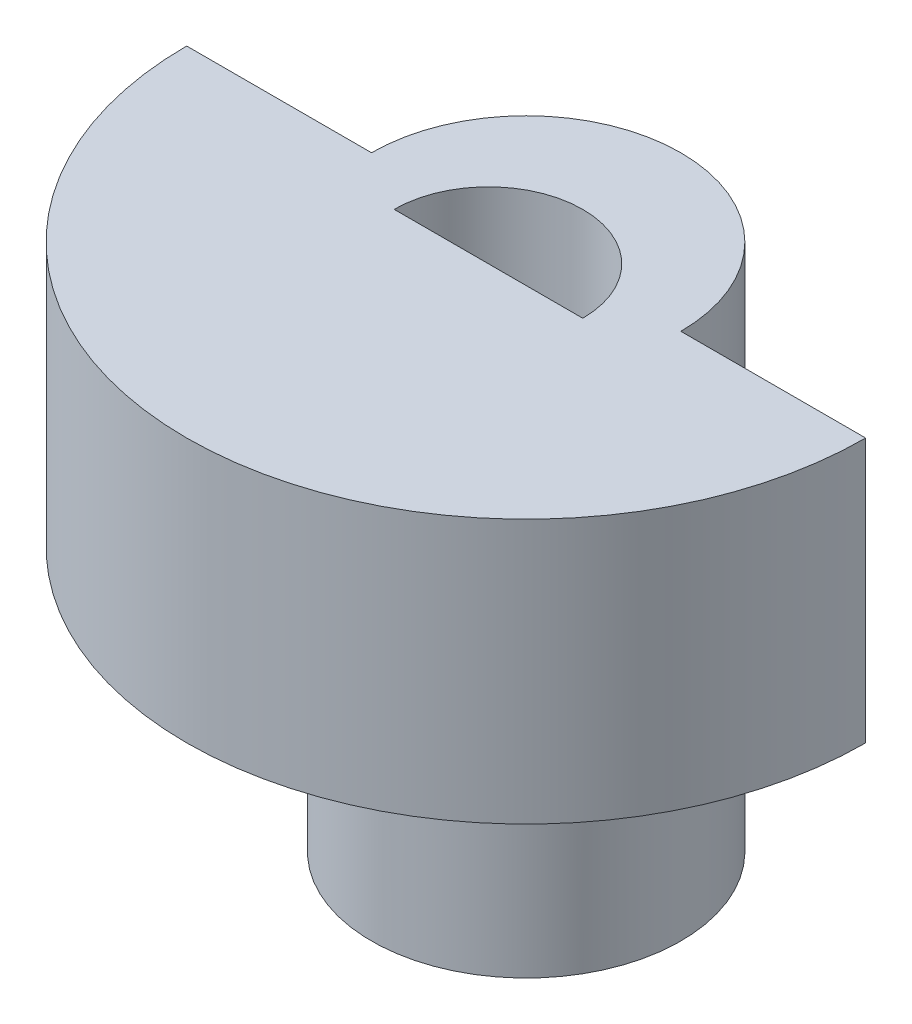
ISO-10303-21;
HEADER;
FILE_DESCRIPTION(('STEP AP214'),'2;1');
FILE_NAME('part.step','',(''),(''),'','','');
FILE_SCHEMA(('AUTOMOTIVE_DESIGN { 1 0 10303 214 1 1 1 1 }'));
ENDSEC;
DATA;
#1=APPLICATION_CONTEXT('core data for automotive mechanical design processes');
#2=APPLICATION_PROTOCOL_DEFINITION('international standard','automotive_design',2000,#1);
#3=PRODUCT_CONTEXT('',#1,'mechanical');
#4=PRODUCT('Part','Part','',(#3));
#5=PRODUCT_RELATED_PRODUCT_CATEGORY('part','',(#4));
#6=PRODUCT_DEFINITION_FORMATION('','',#4);
#7=PRODUCT_DEFINITION_CONTEXT('part definition',#1,'design');
#8=PRODUCT_DEFINITION('design','',#6,#7);
#9=PRODUCT_DEFINITION_SHAPE('','',#8);
#10=(LENGTH_UNIT() NAMED_UNIT(*) SI_UNIT(.MILLI.,.METRE.));
#11=(NAMED_UNIT(*) PLANE_ANGLE_UNIT() SI_UNIT($,.RADIAN.));
#12=(NAMED_UNIT(*) SI_UNIT($,.STERADIAN.) SOLID_ANGLE_UNIT());
#13=UNCERTAINTY_MEASURE_WITH_UNIT(LENGTH_MEASURE(1.E-05),#10,'distance_accuracy_value','');
#14=(GEOMETRIC_REPRESENTATION_CONTEXT(3) GLOBAL_UNCERTAINTY_ASSIGNED_CONTEXT((#13)) GLOBAL_UNIT_ASSIGNED_CONTEXT((#10,
#11,#12)) REPRESENTATION_CONTEXT('',''));
#15=CARTESIAN_POINT('',(0.,0.,0.));
#16=DIRECTION('',(0.,0.,1.));
#17=DIRECTION('',(1.,0.,0.));
#18=AXIS2_PLACEMENT_3D('',#15,#16,#17);
#19=CARTESIAN_POINT('',(0.,0.,0.));
#20=DIRECTION('',(0.,1.,0.));
#21=DIRECTION('',(0.,0.,1.));
#22=AXIS2_PLACEMENT_3D('',#19,#20,#21);
#23=PLANE('',#22);
#24=CARTESIAN_POINT('',(0.,0.,0.));
#25=DIRECTION('',(0.,-1.,0.));
#26=DIRECTION('',(0.,0.,-1.));
#27=AXIS2_PLACEMENT_3D('',#24,#25,#26);
#28=CIRCLE('',#27,4.1);
#29=CARTESIAN_POINT('',(4.1,0.,0.));
#30=VERTEX_POINT('',#29);
#31=CARTESIAN_POINT('',(-4.1,0.,0.));
#32=VERTEX_POINT('',#31);
#33=EDGE_CURVE('E104',#30,#32,#28,.T.);
#34=ORIENTED_EDGE('',*,*,#33,.F.);
#35=DIRECTION('',(-1.,0.,0.));
#36=VECTOR('',#35,1.);
#37=CARTESIAN_POINT('',(4.1,0.,0.));
#38=LINE('',#37,#36);
#39=CARTESIAN_POINT('',(9.,0.,0.));
#40=VERTEX_POINT('',#39);
#41=EDGE_CURVE('E124',#40,#30,#38,.T.);
#42=ORIENTED_EDGE('',*,*,#41,.F.);
#43=CARTESIAN_POINT('',(0.,0.,0.));
#44=DIRECTION('',(0.,1.,0.));
#45=DIRECTION('',(0.,0.,1.));
#46=AXIS2_PLACEMENT_3D('',#43,#44,#45);
#47=CIRCLE('',#46,9.);
#48=CARTESIAN_POINT('',(-9.,0.,0.));
#49=VERTEX_POINT('',#48);
#50=EDGE_CURVE('E119',#49,#40,#47,.T.);
#51=ORIENTED_EDGE('',*,*,#50,.F.);
#52=DIRECTION('',(-1.,0.,0.));
#53=VECTOR('',#52,1.);
#54=CARTESIAN_POINT('',(-4.1,0.,0.));
#55=LINE('',#54,#53);
#56=EDGE_CURVE('E109',#32,#49,#55,.T.);
#57=ORIENTED_EDGE('',*,*,#56,.F.);
#58=EDGE_LOOP('',(#34,#42,#51,#57));
#59=FACE_BOUND('',#58,.T.);
#60=ADVANCED_FACE('F33',(#59),#23,.F.);
#61=CARTESIAN_POINT('',(0.,7.,0.));
#62=DIRECTION('',(0.,-1.,0.));
#63=DIRECTION('',(0.,0.,-1.));
#64=AXIS2_PLACEMENT_3D('',#61,#62,#63);
#65=CYLINDRICAL_SURFACE('',#64,4.1);
#66=DIRECTION('',(0.,-1.,0.));
#67=VECTOR('',#66,1.);
#68=CARTESIAN_POINT('',(4.1,7.,0.));
#69=LINE('',#68,#67);
#70=CARTESIAN_POINT('',(4.1,7.,0.));
#71=VERTEX_POINT('',#70);
#72=EDGE_CURVE('E128',#71,#30,#69,.T.);
#73=ORIENTED_EDGE('',*,*,#72,.T.);
#74=ORIENTED_EDGE('',*,*,#33,.T.);
#75=DIRECTION('',(0.,-1.,0.));
#76=VECTOR('',#75,1.);
#77=CARTESIAN_POINT('',(-4.1,7.,0.));
#78=LINE('',#77,#76);
#79=CARTESIAN_POINT('',(-4.1,7.,0.));
#80=VERTEX_POINT('',#79);
#81=EDGE_CURVE('E11',#80,#32,#78,.T.);
#82=ORIENTED_EDGE('',*,*,#81,.F.);
#83=CARTESIAN_POINT('',(0.,7.,0.));
#84=DIRECTION('',(0.,1.,0.));
#85=DIRECTION('',(0.,0.,1.));
#86=AXIS2_PLACEMENT_3D('',#83,#84,#85);
#87=CIRCLE('',#86,4.1);
#88=EDGE_CURVE('E112',#71,#80,#87,.T.);
#89=ORIENTED_EDGE('',*,*,#88,.F.);
#90=EDGE_LOOP('',(#73,#74,#82,#89));
#91=FACE_BOUND('',#90,.T.);
#92=CARTESIAN_POINT('',(0.,-7.,0.));
#93=DIRECTION('',(0.,-1.,0.));
#94=DIRECTION('',(0.,0.,-1.));
#95=AXIS2_PLACEMENT_3D('',#92,#93,#94);
#96=CIRCLE('',#95,4.1);
#97=CARTESIAN_POINT('',(0.,-7.,-4.1));
#98=VERTEX_POINT('',#97);
#99=EDGE_CURVE('E106',#98,#98,#96,.T.);
#100=ORIENTED_EDGE('',*,*,#99,.F.);
#101=EDGE_LOOP('',(#100));
#102=FACE_BOUND('',#101,.T.);
#103=ADVANCED_FACE('F35',(#91,#102),#65,.T.);
#104=CARTESIAN_POINT('',(-4.1,7.,0.));
#105=DIRECTION('',(0.,0.,1.));
#106=DIRECTION('',(1.,0.,0.));
#107=AXIS2_PLACEMENT_3D('',#104,#105,#106);
#108=PLANE('',#107);
#109=ORIENTED_EDGE('',*,*,#56,.T.);
#110=DIRECTION('',(0.,-1.,0.));
#111=VECTOR('',#110,1.);
#112=CARTESIAN_POINT('',(-9.,7.,0.));
#113=LINE('',#112,#111);
#114=CARTESIAN_POINT('',(-9.,7.,0.));
#115=VERTEX_POINT('',#114);
#116=EDGE_CURVE('E42',#115,#49,#113,.T.);
#117=ORIENTED_EDGE('',*,*,#116,.F.);
#118=DIRECTION('',(-1.,0.,0.));
#119=VECTOR('',#118,1.);
#120=CARTESIAN_POINT('',(-4.1,7.,0.));
#121=LINE('',#120,#119);
#122=EDGE_CURVE('E141',#80,#115,#121,.T.);
#123=ORIENTED_EDGE('',*,*,#122,.F.);
#124=ORIENTED_EDGE('',*,*,#81,.T.);
#125=EDGE_LOOP('',(#109,#117,#123,#124));
#126=FACE_BOUND('',#125,.T.);
#127=ADVANCED_FACE('F159',(#126),#108,.F.);
#128=CARTESIAN_POINT('',(0.,7.,0.));
#129=DIRECTION('',(0.,-1.,0.));
#130=DIRECTION('',(0.,0.,-1.));
#131=AXIS2_PLACEMENT_3D('',#128,#129,#130);
#132=CYLINDRICAL_SURFACE('',#131,9.);
#133=ORIENTED_EDGE('',*,*,#50,.T.);
#134=DIRECTION('',(0.,-1.,0.));
#135=VECTOR('',#134,1.);
#136=CARTESIAN_POINT('',(9.,7.,0.));
#137=LINE('',#136,#135);
#138=CARTESIAN_POINT('',(9.,7.,0.));
#139=VERTEX_POINT('',#138);
#140=EDGE_CURVE('E130',#139,#40,#137,.T.);
#141=ORIENTED_EDGE('',*,*,#140,.F.);
#142=CARTESIAN_POINT('',(0.,7.,0.));
#143=DIRECTION('',(0.,1.,0.));
#144=DIRECTION('',(0.,0.,1.));
#145=AXIS2_PLACEMENT_3D('',#142,#143,#144);
#146=CIRCLE('',#145,9.);
#147=EDGE_CURVE('E136',#115,#139,#146,.T.);
#148=ORIENTED_EDGE('',*,*,#147,.F.);
#149=ORIENTED_EDGE('',*,*,#116,.T.);
#150=EDGE_LOOP('',(#133,#141,#148,#149));
#151=FACE_BOUND('',#150,.T.);
#152=ADVANCED_FACE('F148',(#151),#132,.T.);
#153=CARTESIAN_POINT('',(4.1,7.,0.));
#154=DIRECTION('',(0.,0.,1.));
#155=DIRECTION('',(1.,0.,0.));
#156=AXIS2_PLACEMENT_3D('',#153,#154,#155);
#157=PLANE('',#156);
#158=ORIENTED_EDGE('',*,*,#41,.T.);
#159=ORIENTED_EDGE('',*,*,#72,.F.);
#160=DIRECTION('',(-1.,0.,0.));
#161=VECTOR('',#160,1.);
#162=CARTESIAN_POINT('',(4.1,7.,0.));
#163=LINE('',#162,#161);
#164=EDGE_CURVE('E131',#139,#71,#163,.T.);
#165=ORIENTED_EDGE('',*,*,#164,.F.);
#166=ORIENTED_EDGE('',*,*,#140,.T.);
#167=EDGE_LOOP('',(#158,#159,#165,#166));
#168=FACE_BOUND('',#167,.T.);
#169=ADVANCED_FACE('F155',(#168),#157,.F.);
#170=CARTESIAN_POINT('',(0.,7.,0.));
#171=DIRECTION('',(0.,1.,0.));
#172=DIRECTION('',(0.,0.,1.));
#173=AXIS2_PLACEMENT_3D('',#170,#171,#172);
#174=PLANE('',#173);
#175=CARTESIAN_POINT('',(0.,7.,1.));
#176=DIRECTION('',(0.,1.,0.));
#177=DIRECTION('',(0.,0.,1.));
#178=AXIS2_PLACEMENT_3D('',#175,#176,#177);
#179=CIRCLE('',#178,2.5);
#180=CARTESIAN_POINT('',(2.5,7.,1.));
#181=VERTEX_POINT('',#180);
#182=CARTESIAN_POINT('',(-2.5,7.,1.));
#183=VERTEX_POINT('',#182);
#184=EDGE_CURVE('E50',#181,#183,#179,.T.);
#185=ORIENTED_EDGE('',*,*,#184,.F.);
#186=DIRECTION('',(-1.,0.,0.));
#187=VECTOR('',#186,1.);
#188=CARTESIAN_POINT('',(2.5,7.,1.));
#189=LINE('',#188,#187);
#190=EDGE_CURVE('E99',#181,#183,#189,.T.);
#191=ORIENTED_EDGE('',*,*,#190,.T.);
#192=EDGE_LOOP('',(#185,#191));
#193=FACE_BOUND('',#192,.T.);
#194=ORIENTED_EDGE('',*,*,#88,.T.);
#195=ORIENTED_EDGE('',*,*,#122,.T.);
#196=ORIENTED_EDGE('',*,*,#147,.T.);
#197=ORIENTED_EDGE('',*,*,#164,.T.);
#198=EDGE_LOOP('',(#194,#195,#196,#197));
#199=FACE_BOUND('',#198,.T.);
#200=ADVANCED_FACE('F160',(#193,#199),#174,.T.);
#201=CARTESIAN_POINT('',(0.,-7.,0.));
#202=DIRECTION('',(0.,-1.,0.));
#203=DIRECTION('',(0.,0.,-1.));
#204=AXIS2_PLACEMENT_3D('',#201,#202,#203);
#205=PLANE('',#204);
#206=CARTESIAN_POINT('',(0.,-7.,1.));
#207=DIRECTION('',(0.,1.,0.));
#208=DIRECTION('',(0.,0.,1.));
#209=AXIS2_PLACEMENT_3D('',#206,#207,#208);
#210=CIRCLE('',#209,2.5);
#211=CARTESIAN_POINT('',(2.5,-7.,1.));
#212=VERTEX_POINT('',#211);
#213=CARTESIAN_POINT('',(-2.5,-7.,1.));
#214=VERTEX_POINT('',#213);
#215=EDGE_CURVE('E55',#212,#214,#210,.T.);
#216=ORIENTED_EDGE('',*,*,#215,.T.);
#217=DIRECTION('',(-1.,0.,0.));
#218=VECTOR('',#217,1.);
#219=CARTESIAN_POINT('',(2.5,-7.,1.));
#220=LINE('',#219,#218);
#221=EDGE_CURVE('E87',#212,#214,#220,.T.);
#222=ORIENTED_EDGE('',*,*,#221,.F.);
#223=EDGE_LOOP('',(#216,#222));
#224=FACE_BOUND('',#223,.T.);
#225=ORIENTED_EDGE('',*,*,#99,.T.);
#226=EDGE_LOOP('',(#225));
#227=FACE_BOUND('',#226,.T.);
#228=ADVANCED_FACE('F97',(#224,#227),#205,.T.);
#229=CARTESIAN_POINT('',(0.,-7.,1.));
#230=DIRECTION('',(0.,1.,0.));
#231=DIRECTION('',(0.,0.,1.));
#232=AXIS2_PLACEMENT_3D('',#229,#230,#231);
#233=CYLINDRICAL_SURFACE('',#232,2.5);
#234=ORIENTED_EDGE('',*,*,#184,.T.);
#235=DIRECTION('',(0.,1.,0.));
#236=VECTOR('',#235,1.);
#237=CARTESIAN_POINT('',(-2.5,-7.,1.));
#238=LINE('',#237,#236);
#239=EDGE_CURVE('E90',#214,#183,#238,.T.);
#240=ORIENTED_EDGE('',*,*,#239,.F.);
#241=ORIENTED_EDGE('',*,*,#215,.F.);
#242=DIRECTION('',(0.,1.,0.));
#243=VECTOR('',#242,1.);
#244=CARTESIAN_POINT('',(2.5,-7.,1.));
#245=LINE('',#244,#243);
#246=EDGE_CURVE('E92',#212,#181,#245,.T.);
#247=ORIENTED_EDGE('',*,*,#246,.T.);
#248=EDGE_LOOP('',(#234,#240,#241,#247));
#249=FACE_BOUND('',#248,.T.);
#250=ADVANCED_FACE('F95',(#249),#233,.F.);
#251=CARTESIAN_POINT('',(2.5,-7.,1.));
#252=DIRECTION('',(0.,0.,-1.));
#253=DIRECTION('',(-1.,0.,0.));
#254=AXIS2_PLACEMENT_3D('',#251,#252,#253);
#255=PLANE('',#254);
#256=ORIENTED_EDGE('',*,*,#190,.F.);
#257=ORIENTED_EDGE('',*,*,#246,.F.);
#258=ORIENTED_EDGE('',*,*,#221,.T.);
#259=ORIENTED_EDGE('',*,*,#239,.T.);
#260=EDGE_LOOP('',(#256,#257,#258,#259));
#261=FACE_BOUND('',#260,.T.);
#262=ADVANCED_FACE('F89',(#261),#255,.T.);
#263=CLOSED_SHELL('',(#60,#103,#127,#152,#169,#200,#228,#250,#262));
#264=MANIFOLD_SOLID_BREP('B2',#263);
#265=ADVANCED_BREP_SHAPE_REPRESENTATION('',(#18,#264),#14);
#266=SHAPE_DEFINITION_REPRESENTATION(#9,#265);
ENDSEC;
END-ISO-10303-21;
